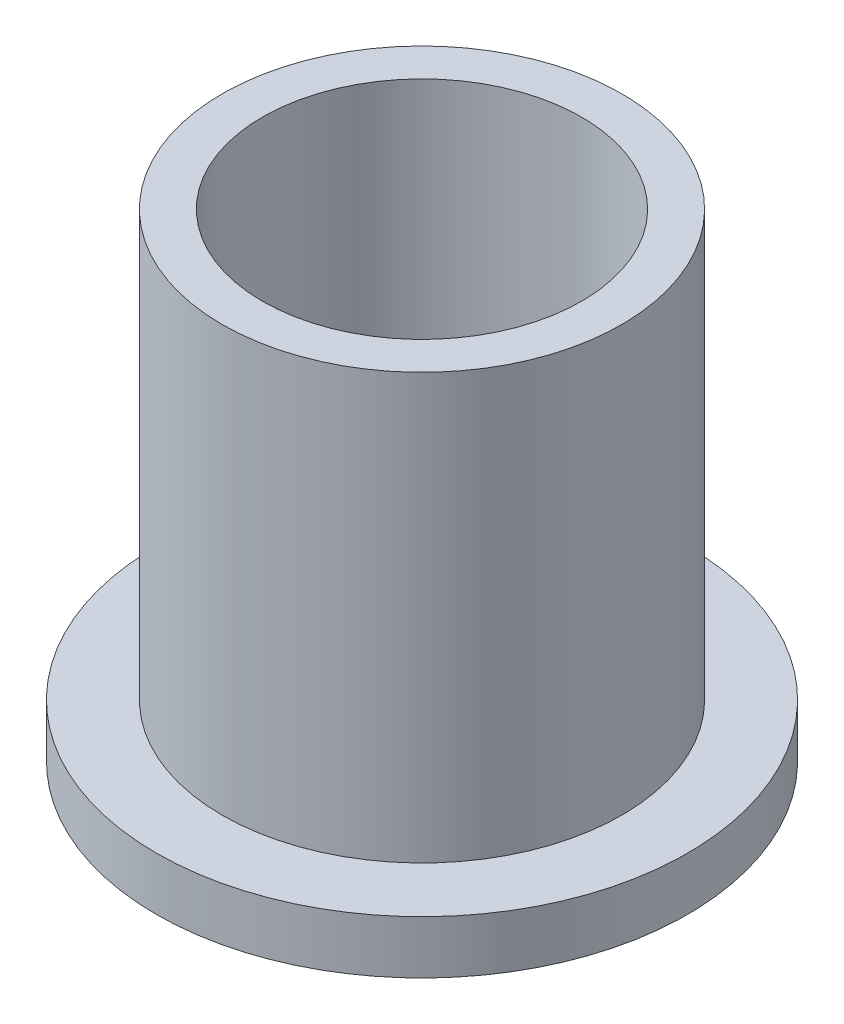
ISO-10303-21;
HEADER;
FILE_DESCRIPTION(('STEP AP214'),'2;1');
FILE_NAME('part.step','',(''),(''),'','','');
FILE_SCHEMA(('AUTOMOTIVE_DESIGN { 1 0 10303 214 1 1 1 1 }'));
ENDSEC;
DATA;
#1=APPLICATION_CONTEXT('core data for automotive mechanical design processes');
#2=APPLICATION_PROTOCOL_DEFINITION('international standard','automotive_design',2000,#1);
#3=PRODUCT_CONTEXT('',#1,'mechanical');
#4=PRODUCT('Part','Part','',(#3));
#5=PRODUCT_RELATED_PRODUCT_CATEGORY('part','',(#4));
#6=PRODUCT_DEFINITION_FORMATION('','',#4);
#7=PRODUCT_DEFINITION_CONTEXT('part definition',#1,'design');
#8=PRODUCT_DEFINITION('design','',#6,#7);
#9=PRODUCT_DEFINITION_SHAPE('','',#8);
#10=(LENGTH_UNIT() NAMED_UNIT(*) SI_UNIT(.MILLI.,.METRE.));
#11=(NAMED_UNIT(*) PLANE_ANGLE_UNIT() SI_UNIT($,.RADIAN.));
#12=(NAMED_UNIT(*) SI_UNIT($,.STERADIAN.) SOLID_ANGLE_UNIT());
#13=UNCERTAINTY_MEASURE_WITH_UNIT(LENGTH_MEASURE(1.E-05),#10,'distance_accuracy_value','');
#14=(GEOMETRIC_REPRESENTATION_CONTEXT(3) GLOBAL_UNCERTAINTY_ASSIGNED_CONTEXT((#13)) GLOBAL_UNIT_ASSIGNED_CONTEXT((#10,
#11,#12)) REPRESENTATION_CONTEXT('',''));
#15=CARTESIAN_POINT('',(0.,0.,0.));
#16=DIRECTION('',(0.,0.,1.));
#17=DIRECTION('',(1.,0.,0.));
#18=AXIS2_PLACEMENT_3D('',#15,#16,#17);
#19=CARTESIAN_POINT('',(0.,28.575,0.));
#20=DIRECTION('',(0.,1.,0.));
#21=DIRECTION('',(0.,0.,1.));
#22=AXIS2_PLACEMENT_3D('',#19,#20,#21);
#23=PLANE('',#22);
#24=CARTESIAN_POINT('',(0.,28.575,0.));
#25=DIRECTION('',(0.,1.,0.));
#26=DIRECTION('',(0.,0.,1.));
#27=AXIS2_PLACEMENT_3D('',#24,#25,#26);
#28=CIRCLE('',#27,11.94435);
#29=CARTESIAN_POINT('',(0.,28.575,11.94435));
#30=VERTEX_POINT('',#29);
#31=EDGE_CURVE('E10',#30,#30,#28,.T.);
#32=ORIENTED_EDGE('',*,*,#31,.T.);
#33=EDGE_LOOP('',(#32));
#34=FACE_BOUND('',#33,.T.);
#35=CARTESIAN_POINT('',(0.,28.575,0.));
#36=DIRECTION('',(0.,1.,0.));
#37=DIRECTION('',(0.,0.,1.));
#38=AXIS2_PLACEMENT_3D('',#35,#36,#37);
#39=CIRCLE('',#38,9.5377);
#40=CARTESIAN_POINT('',(0.,28.575,9.5377));
#41=VERTEX_POINT('',#40);
#42=EDGE_CURVE('E39',#41,#41,#39,.T.);
#43=ORIENTED_EDGE('',*,*,#42,.F.);
#44=EDGE_LOOP('',(#43));
#45=FACE_BOUND('',#44,.T.);
#46=ADVANCED_FACE('F32',(#34,#45),#23,.T.);
#47=CARTESIAN_POINT('',(0.,0.,0.));
#48=DIRECTION('',(0.,1.,0.));
#49=DIRECTION('',(0.,0.,1.));
#50=AXIS2_PLACEMENT_3D('',#47,#48,#49);
#51=PLANE('',#50);
#52=CARTESIAN_POINT('',(0.,0.,0.));
#53=DIRECTION('',(0.,1.,0.));
#54=DIRECTION('',(0.,0.,1.));
#55=AXIS2_PLACEMENT_3D('',#52,#53,#54);
#56=CIRCLE('',#55,9.5377);
#57=CARTESIAN_POINT('',(0.,0.,9.5377));
#58=VERTEX_POINT('',#57);
#59=EDGE_CURVE('E43',#58,#58,#56,.T.);
#60=ORIENTED_EDGE('',*,*,#59,.T.);
#61=EDGE_LOOP('',(#60));
#62=FACE_BOUND('',#61,.T.);
#63=CARTESIAN_POINT('',(0.,0.,0.));
#64=DIRECTION('',(0.,1.,0.));
#65=DIRECTION('',(0.,0.,1.));
#66=AXIS2_PLACEMENT_3D('',#63,#64,#65);
#67=CIRCLE('',#66,15.875);
#68=CARTESIAN_POINT('',(0.,0.,15.875));
#69=VERTEX_POINT('',#68);
#70=EDGE_CURVE('E50',#69,#69,#67,.T.);
#71=ORIENTED_EDGE('',*,*,#70,.F.);
#72=EDGE_LOOP('',(#71));
#73=FACE_BOUND('',#72,.T.);
#74=ADVANCED_FACE('F75',(#62,#73),#51,.F.);
#75=CARTESIAN_POINT('',(0.,28.575,0.));
#76=DIRECTION('',(0.,-1.,0.));
#77=DIRECTION('',(0.,0.,-1.));
#78=AXIS2_PLACEMENT_3D('',#75,#76,#77);
#79=CYLINDRICAL_SURFACE('',#78,11.94435);
#80=CARTESIAN_POINT('',(0.,3.175,0.));
#81=DIRECTION('',(0.,1.,0.));
#82=DIRECTION('',(0.,0.,1.));
#83=AXIS2_PLACEMENT_3D('',#80,#81,#82);
#84=CIRCLE('',#83,11.94435);
#85=CARTESIAN_POINT('',(0.,3.175,11.94435));
#86=VERTEX_POINT('',#85);
#87=EDGE_CURVE('E53',#86,#86,#84,.T.);
#88=ORIENTED_EDGE('',*,*,#87,.T.);
#89=EDGE_LOOP('',(#88));
#90=FACE_BOUND('',#89,.T.);
#91=ORIENTED_EDGE('',*,*,#31,.F.);
#92=EDGE_LOOP('',(#91));
#93=FACE_BOUND('',#92,.T.);
#94=ADVANCED_FACE('F34',(#90,#93),#79,.T.);
#95=CARTESIAN_POINT('',(0.,28.575,0.));
#96=DIRECTION('',(0.,-1.,0.));
#97=DIRECTION('',(0.,0.,-1.));
#98=AXIS2_PLACEMENT_3D('',#95,#96,#97);
#99=CYLINDRICAL_SURFACE('',#98,9.5377);
#100=ORIENTED_EDGE('',*,*,#42,.T.);
#101=EDGE_LOOP('',(#100));
#102=FACE_BOUND('',#101,.T.);
#103=ORIENTED_EDGE('',*,*,#59,.F.);
#104=EDGE_LOOP('',(#103));
#105=FACE_BOUND('',#104,.T.);
#106=ADVANCED_FACE('F64',(#102,#105),#99,.F.);
#107=CARTESIAN_POINT('',(0.,3.175,0.));
#108=DIRECTION('',(0.,1.,0.));
#109=DIRECTION('',(0.,0.,1.));
#110=AXIS2_PLACEMENT_3D('',#107,#108,#109);
#111=PLANE('',#110);
#112=CARTESIAN_POINT('',(0.,3.175,0.));
#113=DIRECTION('',(0.,1.,0.));
#114=DIRECTION('',(0.,0.,1.));
#115=AXIS2_PLACEMENT_3D('',#112,#113,#114);
#116=CIRCLE('',#115,15.875);
#117=CARTESIAN_POINT('',(0.,3.175,15.875));
#118=VERTEX_POINT('',#117);
#119=EDGE_CURVE('E48',#118,#118,#116,.T.);
#120=ORIENTED_EDGE('',*,*,#119,.T.);
#121=EDGE_LOOP('',(#120));
#122=FACE_BOUND('',#121,.T.);
#123=ORIENTED_EDGE('',*,*,#87,.F.);
#124=EDGE_LOOP('',(#123));
#125=FACE_BOUND('',#124,.T.);
#126=ADVANCED_FACE('F61',(#122,#125),#111,.T.);
#127=CARTESIAN_POINT('',(0.,3.175,0.));
#128=DIRECTION('',(0.,-1.,0.));
#129=DIRECTION('',(0.,0.,-1.));
#130=AXIS2_PLACEMENT_3D('',#127,#128,#129);
#131=CYLINDRICAL_SURFACE('',#130,15.875);
#132=ORIENTED_EDGE('',*,*,#119,.F.);
#133=EDGE_LOOP('',(#132));
#134=FACE_BOUND('',#133,.T.);
#135=ORIENTED_EDGE('',*,*,#70,.T.);
#136=EDGE_LOOP('',(#135));
#137=FACE_BOUND('',#136,.T.);
#138=ADVANCED_FACE('F63',(#134,#137),#131,.T.);
#139=CLOSED_SHELL('',(#46,#74,#94,#106,#126,#138));
#140=MANIFOLD_SOLID_BREP('B2',#139);
#141=ADVANCED_BREP_SHAPE_REPRESENTATION('',(#18,#140),#14);
#142=SHAPE_DEFINITION_REPRESENTATION(#9,#141);
ENDSEC;
END-ISO-10303-21;
